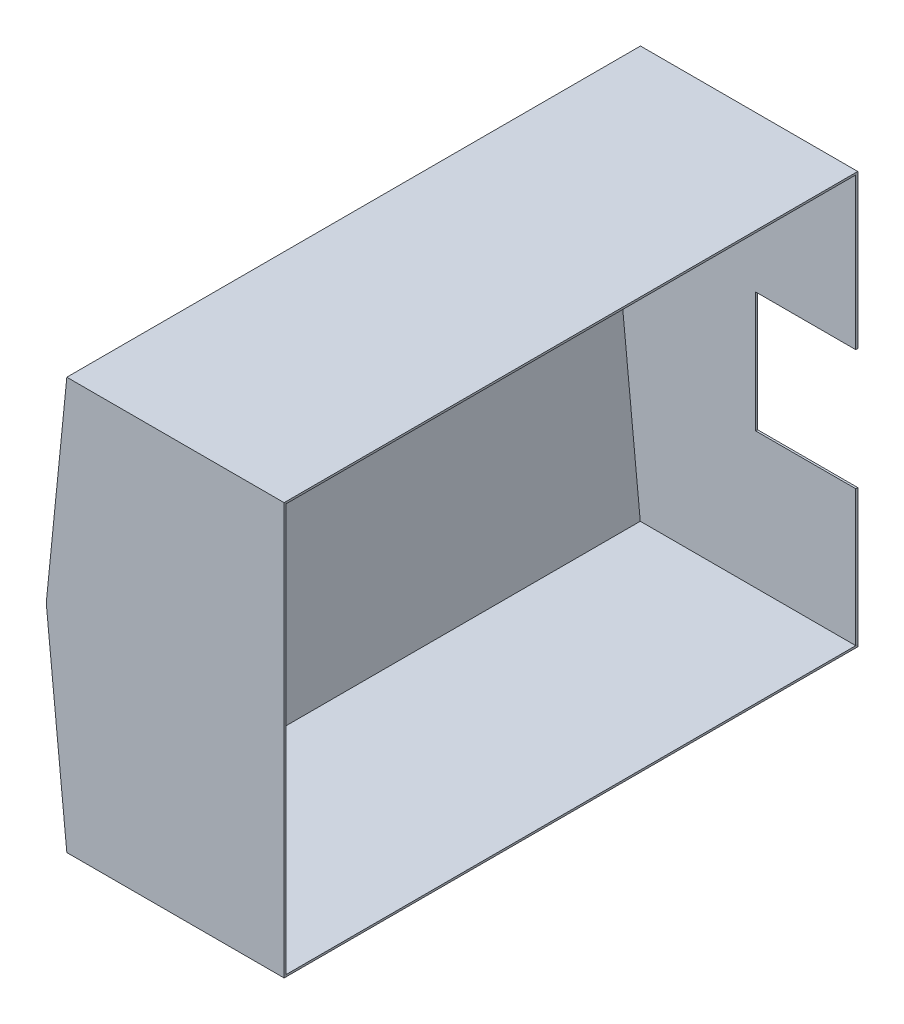
ISO-10303-21;
HEADER;
FILE_DESCRIPTION(('STEP AP214'),'2;1');
FILE_NAME('part.step','',(''),(''),'','','');
FILE_SCHEMA(('AUTOMOTIVE_DESIGN { 1 0 10303 214 1 1 1 1 }'));
ENDSEC;
DATA;
#1=APPLICATION_CONTEXT('core data for automotive mechanical design processes');
#2=APPLICATION_PROTOCOL_DEFINITION('international standard','automotive_design',2000,#1);
#3=PRODUCT_CONTEXT('',#1,'mechanical');
#4=PRODUCT('Part','Part','',(#3));
#5=PRODUCT_RELATED_PRODUCT_CATEGORY('part','',(#4));
#6=PRODUCT_DEFINITION_FORMATION('','',#4);
#7=PRODUCT_DEFINITION_CONTEXT('part definition',#1,'design');
#8=PRODUCT_DEFINITION('design','',#6,#7);
#9=PRODUCT_DEFINITION_SHAPE('','',#8);
#10=(LENGTH_UNIT() NAMED_UNIT(*) SI_UNIT(.MILLI.,.METRE.));
#11=(NAMED_UNIT(*) PLANE_ANGLE_UNIT() SI_UNIT($,.RADIAN.));
#12=(NAMED_UNIT(*) SI_UNIT($,.STERADIAN.) SOLID_ANGLE_UNIT());
#13=UNCERTAINTY_MEASURE_WITH_UNIT(LENGTH_MEASURE(1.E-05),#10,'distance_accuracy_value','');
#14=(GEOMETRIC_REPRESENTATION_CONTEXT(3) GLOBAL_UNCERTAINTY_ASSIGNED_CONTEXT((#13)) GLOBAL_UNIT_ASSIGNED_CONTEXT((#10,
#11,#12)) REPRESENTATION_CONTEXT('',''));
#15=CARTESIAN_POINT('',(0.,0.,0.));
#16=DIRECTION('',(0.,0.,1.));
#17=DIRECTION('',(1.,0.,0.));
#18=AXIS2_PLACEMENT_3D('',#15,#16,#17);
#19=CARTESIAN_POINT('',(2998.99999999998,-3829.13009448714,100.));
#20=DIRECTION('',(-0.999999996719112,-8.10047953470063E-05,0.));
#21=DIRECTION('',(8.10047953470063E-05,-0.999999996719112,0.));
#22=AXIS2_PLACEMENT_3D('',#19,#20,#21);
#23=PLANE('',#22);
#24=DIRECTION('',(-8.10047953470063E-05,0.999999996719112,0.));
#25=VECTOR('',#24,1.);
#26=CARTESIAN_POINT('',(2999.67018965715,-12102.5866485027,0.));
#27=LINE('',#26,#25);
#28=CARTESIAN_POINT('',(2999.00810047952,-3929.13009415905,0.));
#29=VERTEX_POINT('',#28);
#30=CARTESIAN_POINT('',(2998.99999999998,-3829.13009448714,0.));
#31=VERTEX_POINT('',#30);
#32=EDGE_CURVE('E156',#29,#31,#27,.T.);
#33=ORIENTED_EDGE('',*,*,#32,.F.);
#34=DIRECTION('',(0.,0.,-1.));
#35=VECTOR('',#34,1.);
#36=CARTESIAN_POINT('',(2999.00810047952,-3929.13009415905,100.));
#37=LINE('',#36,#35);
#38=CARTESIAN_POINT('',(2999.00810047952,-3929.13009415905,-28490.));
#39=VERTEX_POINT('',#38);
#40=EDGE_CURVE('E151',#29,#39,#37,.T.);
#41=ORIENTED_EDGE('',*,*,#40,.T.);
#42=DIRECTION('',(-8.10047953470063E-05,0.999999996719112,0.));
#43=VECTOR('',#42,1.);
#44=CARTESIAN_POINT('',(2998.99999999998,-3829.13009448714,-28490.));
#45=LINE('',#44,#43);
#46=CARTESIAN_POINT('',(2998.99999999998,-3829.13009448714,-28490.));
#47=VERTEX_POINT('',#46);
#48=EDGE_CURVE('E241',#39,#47,#45,.T.);
#49=ORIENTED_EDGE('',*,*,#48,.T.);
#50=DIRECTION('',(0.,0.,-1.));
#51=VECTOR('',#50,1.);
#52=CARTESIAN_POINT('',(2998.99999999998,-3829.13009448714,-28390.));
#53=LINE('',#52,#51);
#54=CARTESIAN_POINT('',(2998.99999999998,-3829.13009448714,-28390.));
#55=VERTEX_POINT('',#54);
#56=EDGE_CURVE('E224',#55,#47,#53,.T.);
#57=ORIENTED_EDGE('',*,*,#56,.F.);
#58=DIRECTION('',(0.,0.,-1.));
#59=VECTOR('',#58,1.);
#60=CARTESIAN_POINT('',(2998.99999999998,-3829.13009448714,100.));
#61=LINE('',#60,#59);
#62=EDGE_CURVE('E11',#31,#55,#61,.T.);
#63=ORIENTED_EDGE('',*,*,#62,.F.);
#64=EDGE_LOOP('',(#33,#41,#49,#57,#63));
#65=FACE_BOUND('',#64,.T.);
#66=ADVANCED_FACE('F30',(#65),#23,.F.);
#67=CARTESIAN_POINT('',(2998.99999999998,-3829.13009448714,100.));
#68=DIRECTION('',(8.10047953486023E-05,-0.999999996719112,0.));
#69=DIRECTION('',(0.999999996719112,8.10047953486023E-05,0.));
#70=AXIS2_PLACEMENT_3D('',#67,#68,#69);
#71=PLANE('',#70);
#72=DIRECTION('',(-0.999999996719112,-8.10047953486023E-05,0.));
#73=VECTOR('',#72,1.);
#74=CARTESIAN_POINT('',(-2929.38473390512,-3829.61032208084,0.));
#75=LINE('',#74,#73);
#76=CARTESIAN_POINT('',(-7739.93843276424,-3830.,0.));
#77=VERTEX_POINT('',#76);
#78=EDGE_CURVE('E229',#31,#77,#75,.T.);
#79=ORIENTED_EDGE('',*,*,#78,.F.);
#80=ORIENTED_EDGE('',*,*,#62,.T.);
#81=DIRECTION('',(-0.999999996719112,-8.10047953486023E-05,0.));
#82=VECTOR('',#81,1.);
#83=CARTESIAN_POINT('',(2998.99999999998,-3829.13009448714,-28390.));
#84=LINE('',#83,#82);
#85=CARTESIAN_POINT('',(-7739.93843276424,-3830.,-28390.));
#86=VERTEX_POINT('',#85);
#87=EDGE_CURVE('E201',#55,#86,#84,.T.);
#88=ORIENTED_EDGE('',*,*,#87,.T.);
#89=DIRECTION('',(0.,0.,-1.));
#90=VECTOR('',#89,1.);
#91=CARTESIAN_POINT('',(-7739.93843276424,-3830.,100.));
#92=LINE('',#91,#90);
#93=EDGE_CURVE('E37',#77,#86,#92,.T.);
#94=ORIENTED_EDGE('',*,*,#93,.F.);
#95=EDGE_LOOP('',(#79,#80,#88,#94));
#96=FACE_BOUND('',#95,.T.);
#97=ADVANCED_FACE('F323',(#96),#71,.F.);
#98=CARTESIAN_POINT('',(-7739.93843276424,-3830.,100.));
#99=DIRECTION('',(-0.995037190209989,-0.0995037190209953,0.));
#100=DIRECTION('',(0.0995037190209953,-0.99503719020999,0.));
#101=AXIS2_PLACEMENT_3D('',#98,#99,#100);
#102=PLANE('',#101);
#103=DIRECTION('',(-0.0995037190209953,0.99503719020999,0.));
#104=VECTOR('',#103,1.);
#105=CARTESIAN_POINT('',(-6873.18702039318,-12497.5141237109,0.));
#106=LINE('',#105,#104);
#107=CARTESIAN_POINT('',(-8755.93843276419,6329.99999999988,0.));
#108=VERTEX_POINT('',#107);
#109=EDGE_CURVE('E289',#77,#108,#106,.T.);
#110=ORIENTED_EDGE('',*,*,#109,.F.);
#111=ORIENTED_EDGE('',*,*,#93,.T.);
#112=DIRECTION('',(-0.0995037190209953,0.995037190209989,0.));
#113=VECTOR('',#112,1.);
#114=CARTESIAN_POINT('',(-7739.93843276424,-3830.,-28390.));
#115=LINE('',#114,#113);
#116=CARTESIAN_POINT('',(-8755.93843276419,6329.99999999988,-28390.));
#117=VERTEX_POINT('',#116);
#118=EDGE_CURVE('E197',#86,#117,#115,.T.);
#119=ORIENTED_EDGE('',*,*,#118,.T.);
#120=DIRECTION('',(0.,0.,-1.));
#121=VECTOR('',#120,1.);
#122=CARTESIAN_POINT('',(-8755.93843276419,6329.99999999988,100.));
#123=LINE('',#122,#121);
#124=EDGE_CURVE('E185',#108,#117,#123,.T.);
#125=ORIENTED_EDGE('',*,*,#124,.F.);
#126=EDGE_LOOP('',(#110,#111,#119,#125));
#127=FACE_BOUND('',#126,.T.);
#128=ADVANCED_FACE('F198',(#127),#102,.F.);
#129=CARTESIAN_POINT('',(-8755.93843276419,6329.99999999988,100.));
#130=DIRECTION('',(-0.99503719020999,0.099503719020993,0.));
#131=DIRECTION('',(-0.0995037190209931,-0.99503719020999,0.));
#132=AXIS2_PLACEMENT_3D('',#129,#130,#131);
#133=PLANE('',#132);
#134=DIRECTION('',(0.099503719020993,0.99503719020999,0.));
#135=VECTOR('',#134,1.);
#136=CARTESIAN_POINT('',(-10523.2992730853,-11343.6084032127,0.));
#137=LINE('',#136,#135);
#138=CARTESIAN_POINT('',(-7740.07721241072,16488.6122035352,0.));
#139=VERTEX_POINT('',#138);
#140=EDGE_CURVE('E195',#108,#139,#137,.T.);
#141=ORIENTED_EDGE('',*,*,#140,.F.);
#142=ORIENTED_EDGE('',*,*,#124,.T.);
#143=DIRECTION('',(0.099503719020993,0.99503719020999,0.));
#144=VECTOR('',#143,1.);
#145=CARTESIAN_POINT('',(-8755.93843276419,6329.99999999988,-28390.));
#146=LINE('',#145,#144);
#147=CARTESIAN_POINT('',(-7740.07721241072,16488.6122035352,-28390.));
#148=VERTEX_POINT('',#147);
#149=EDGE_CURVE('E193',#117,#148,#146,.T.);
#150=ORIENTED_EDGE('',*,*,#149,.T.);
#151=DIRECTION('',(0.,0.,-1.));
#152=VECTOR('',#151,1.);
#153=CARTESIAN_POINT('',(-7740.07721241072,16488.6122035352,100.));
#154=LINE('',#153,#152);
#155=EDGE_CURVE('E183',#139,#148,#154,.T.);
#156=ORIENTED_EDGE('',*,*,#155,.F.);
#157=EDGE_LOOP('',(#141,#142,#150,#156));
#158=FACE_BOUND('',#157,.T.);
#159=ADVANCED_FACE('F190',(#158),#133,.F.);
#160=CARTESIAN_POINT('',(2998.99999999998,16488.6122035352,100.));
#161=DIRECTION('',(0.,1.,0.));
#162=DIRECTION('',(0.,0.,1.));
#163=AXIS2_PLACEMENT_3D('',#160,#161,#162);
#164=PLANE('',#163);
#165=DIRECTION('',(1.,0.,0.));
#166=VECTOR('',#165,1.);
#167=CARTESIAN_POINT('',(-2928.71454424794,16488.6122035352,0.));
#168=LINE('',#167,#166);
#169=CARTESIAN_POINT('',(2998.99999999998,16488.6122035352,0.));
#170=VERTEX_POINT('',#169);
#171=EDGE_CURVE('E292',#139,#170,#168,.T.);
#172=ORIENTED_EDGE('',*,*,#171,.F.);
#173=ORIENTED_EDGE('',*,*,#155,.T.);
#174=DIRECTION('',(1.,0.,0.));
#175=VECTOR('',#174,1.);
#176=CARTESIAN_POINT('',(-7740.07721241072,16488.6122035352,-28390.));
#177=LINE('',#176,#175);
#178=CARTESIAN_POINT('',(2998.99999999998,16488.6122035352,-28390.));
#179=VERTEX_POINT('',#178);
#180=EDGE_CURVE('E207',#148,#179,#177,.T.);
#181=ORIENTED_EDGE('',*,*,#180,.T.);
#182=DIRECTION('',(0.,0.,-1.));
#183=VECTOR('',#182,1.);
#184=CARTESIAN_POINT('',(2998.99999999998,16488.6122035352,100.));
#185=LINE('',#184,#183);
#186=EDGE_CURVE('E181',#170,#179,#185,.T.);
#187=ORIENTED_EDGE('',*,*,#186,.F.);
#188=EDGE_LOOP('',(#172,#173,#181,#187));
#189=FACE_BOUND('',#188,.T.);
#190=ADVANCED_FACE('F299',(#189),#164,.F.);
#191=CARTESIAN_POINT('',(2998.99999999998,16488.6122035352,100.));
#192=DIRECTION('',(-1.,0.,0.));
#193=DIRECTION('',(0.,0.,1.));
#194=AXIS2_PLACEMENT_3D('',#191,#192,#193);
#195=PLANE('',#194);
#196=DIRECTION('',(0.,1.,0.));
#197=VECTOR('',#196,1.);
#198=CARTESIAN_POINT('',(2998.99999999998,-12103.0668760964,0.));
#199=LINE('',#198,#197);
#200=CARTESIAN_POINT('',(2998.99999999998,16588.6122035352,0.));
#201=VERTEX_POINT('',#200);
#202=EDGE_CURVE('E158',#170,#201,#199,.T.);
#203=ORIENTED_EDGE('',*,*,#202,.F.);
#204=ORIENTED_EDGE('',*,*,#186,.T.);
#205=DIRECTION('',(0.,-1.,0.));
#206=VECTOR('',#205,1.);
#207=CARTESIAN_POINT('',(2998.99999999998,16488.6122035352,-28390.));
#208=LINE('',#207,#206);
#209=CARTESIAN_POINT('',(2998.99999999998,8944.79822539326,-28390.));
#210=VERTEX_POINT('',#209);
#211=EDGE_CURVE('E209',#179,#210,#208,.T.);
#212=ORIENTED_EDGE('',*,*,#211,.T.);
#213=DIRECTION('',(0.,0.,-1.));
#214=VECTOR('',#213,1.);
#215=CARTESIAN_POINT('',(2998.99999999998,8944.79822539326,-28390.));
#216=LINE('',#215,#214);
#217=CARTESIAN_POINT('',(2998.99999999998,8944.79822539326,-28490.));
#218=VERTEX_POINT('',#217);
#219=EDGE_CURVE('E246',#210,#218,#216,.T.);
#220=ORIENTED_EDGE('',*,*,#219,.T.);
#221=DIRECTION('',(0.,1.,0.));
#222=VECTOR('',#221,1.);
#223=CARTESIAN_POINT('',(2998.99999999998,16488.6122035352,-28490.));
#224=LINE('',#223,#222);
#225=CARTESIAN_POINT('',(2998.99999999998,16588.6122035352,-28490.));
#226=VERTEX_POINT('',#225);
#227=EDGE_CURVE('E252',#218,#226,#224,.T.);
#228=ORIENTED_EDGE('',*,*,#227,.T.);
#229=DIRECTION('',(0.,0.,-1.));
#230=VECTOR('',#229,1.);
#231=CARTESIAN_POINT('',(2998.99999999998,16588.6122035352,100.));
#232=LINE('',#231,#230);
#233=EDGE_CURVE('E177',#201,#226,#232,.T.);
#234=ORIENTED_EDGE('',*,*,#233,.F.);
#235=EDGE_LOOP('',(#203,#204,#212,#220,#228,#234));
#236=FACE_BOUND('',#235,.T.);
#237=ADVANCED_FACE('F298',(#236),#195,.F.);
#238=CARTESIAN_POINT('',(2998.99999999998,16588.6122035352,100.));
#239=DIRECTION('',(0.,-1.,0.));
#240=DIRECTION('',(0.,0.,-1.));
#241=AXIS2_PLACEMENT_3D('',#238,#239,#240);
#242=PLANE('',#241);
#243=CARTESIAN_POINT('',(2998.99999999998,16588.6122035352,100.));
#244=VERTEX_POINT('',#243);
#245=EDGE_CURVE('E178',#244,#201,#232,.T.);
#246=ORIENTED_EDGE('',*,*,#245,.T.);
#247=ORIENTED_EDGE('',*,*,#233,.T.);
#248=DIRECTION('',(-1.,0.,0.));
#249=VECTOR('',#248,1.);
#250=CARTESIAN_POINT('',(2998.99999999998,16588.6122035352,-28490.));
#251=LINE('',#250,#249);
#252=CARTESIAN_POINT('',(-7830.57596862193,16588.6122035352,-28490.));
#253=VERTEX_POINT('',#252);
#254=EDGE_CURVE('E255',#226,#253,#251,.T.);
#255=ORIENTED_EDGE('',*,*,#254,.T.);
#256=DIRECTION('',(0.,0.,-1.));
#257=VECTOR('',#256,1.);
#258=CARTESIAN_POINT('',(-7830.57596862193,16588.6122035352,100.));
#259=LINE('',#258,#257);
#260=CARTESIAN_POINT('',(-7830.57596862193,16588.6122035352,100.));
#261=VERTEX_POINT('',#260);
#262=EDGE_CURVE('E175',#261,#253,#259,.T.);
#263=ORIENTED_EDGE('',*,*,#262,.F.);
#264=DIRECTION('',(-1.,0.,0.));
#265=VECTOR('',#264,1.);
#266=CARTESIAN_POINT('',(2998.99999999998,16588.6122035352,100.));
#267=LINE('',#266,#265);
#268=EDGE_CURVE('E265',#244,#261,#267,.T.);
#269=ORIENTED_EDGE('',*,*,#268,.F.);
#270=EDGE_LOOP('',(#246,#247,#255,#263,#269));
#271=FACE_BOUND('',#270,.T.);
#272=ADVANCED_FACE('F310',(#271),#242,.F.);
#273=CARTESIAN_POINT('',(-8856.4371889754,6329.99999999988,100.));
#274=DIRECTION('',(0.99503719020999,-0.0995037190209931,0.));
#275=DIRECTION('',(0.0995037190209931,0.99503719020999,0.));
#276=AXIS2_PLACEMENT_3D('',#273,#274,#275);
#277=PLANE('',#276);
#278=ORIENTED_EDGE('',*,*,#262,.T.);
#279=DIRECTION('',(-0.0995037190209931,-0.99503719020999,0.));
#280=VECTOR('',#279,1.);
#281=CARTESIAN_POINT('',(-8856.4371889754,6329.99999999988,-28490.));
#282=LINE('',#281,#280);
#283=CARTESIAN_POINT('',(-8856.4371889754,6329.99999999988,-28490.));
#284=VERTEX_POINT('',#283);
#285=EDGE_CURVE('E258',#253,#284,#282,.T.);
#286=ORIENTED_EDGE('',*,*,#285,.T.);
#287=DIRECTION('',(0.,0.,-1.));
#288=VECTOR('',#287,1.);
#289=CARTESIAN_POINT('',(-8856.4371889754,6329.99999999988,100.));
#290=LINE('',#289,#288);
#291=CARTESIAN_POINT('',(-8856.4371889754,6329.99999999988,100.));
#292=VERTEX_POINT('',#291);
#293=EDGE_CURVE('E173',#292,#284,#290,.T.);
#294=ORIENTED_EDGE('',*,*,#293,.F.);
#295=DIRECTION('',(-0.0995037190209931,-0.99503719020999,0.));
#296=VECTOR('',#295,1.);
#297=CARTESIAN_POINT('',(-8856.4371889754,6329.99999999988,100.));
#298=LINE('',#297,#296);
#299=EDGE_CURVE('E267',#261,#292,#298,.T.);
#300=ORIENTED_EDGE('',*,*,#299,.F.);
#301=EDGE_LOOP('',(#278,#286,#294,#300));
#302=FACE_BOUND('',#301,.T.);
#303=ADVANCED_FACE('F313',(#302),#277,.F.);
#304=CARTESIAN_POINT('',(-7830.43645586525,-3930.00733110196,100.));
#305=DIRECTION('',(0.99503719020999,0.0995037190209953,0.));
#306=DIRECTION('',(-0.0995037190209953,0.99503719020999,0.));
#307=AXIS2_PLACEMENT_3D('',#304,#305,#306);
#308=PLANE('',#307);
#309=ORIENTED_EDGE('',*,*,#293,.T.);
#310=DIRECTION('',(0.0995037190209953,-0.995037190209989,0.));
#311=VECTOR('',#310,1.);
#312=CARTESIAN_POINT('',(-7830.43645586525,-3930.00733110196,-28490.));
#313=LINE('',#312,#311);
#314=CARTESIAN_POINT('',(-7830.43645586525,-3930.00733110196,-28490.));
#315=VERTEX_POINT('',#314);
#316=EDGE_CURVE('E261',#284,#315,#313,.T.);
#317=ORIENTED_EDGE('',*,*,#316,.T.);
#318=DIRECTION('',(0.,0.,-1.));
#319=VECTOR('',#318,1.);
#320=CARTESIAN_POINT('',(-7830.43645586525,-3930.00733110196,100.));
#321=LINE('',#320,#319);
#322=CARTESIAN_POINT('',(-7830.43645586525,-3930.00733110196,100.));
#323=VERTEX_POINT('',#322);
#324=EDGE_CURVE('E150',#323,#315,#321,.T.);
#325=ORIENTED_EDGE('',*,*,#324,.F.);
#326=DIRECTION('',(0.0995037190209953,-0.995037190209989,0.));
#327=VECTOR('',#326,1.);
#328=CARTESIAN_POINT('',(-7830.43645586525,-3930.00733110196,100.));
#329=LINE('',#328,#327);
#330=EDGE_CURVE('E168',#292,#323,#329,.T.);
#331=ORIENTED_EDGE('',*,*,#330,.F.);
#332=EDGE_LOOP('',(#309,#317,#325,#331));
#333=FACE_BOUND('',#332,.T.);
#334=ADVANCED_FACE('F275',(#333),#308,.F.);
#335=CARTESIAN_POINT('',(2999.00810047952,-3929.13009415905,100.));
#336=DIRECTION('',(-8.10047953486135E-05,0.999999996719112,0.));
#337=DIRECTION('',(-0.999999996719112,-8.10047953486135E-05,0.));
#338=AXIS2_PLACEMENT_3D('',#335,#336,#337);
#339=PLANE('',#338);
#340=ORIENTED_EDGE('',*,*,#324,.T.);
#341=DIRECTION('',(0.999999996719112,8.10047953486135E-05,0.));
#342=VECTOR('',#341,1.);
#343=CARTESIAN_POINT('',(2999.00810047952,-3929.13009415905,-28490.));
#344=LINE('',#343,#342);
#345=EDGE_CURVE('E166',#315,#39,#344,.T.);
#346=ORIENTED_EDGE('',*,*,#345,.T.);
#347=ORIENTED_EDGE('',*,*,#40,.F.);
#348=CARTESIAN_POINT('',(2999.00810047952,-3929.13009415905,100.));
#349=VERTEX_POINT('',#348);
#350=EDGE_CURVE('E139',#349,#29,#37,.T.);
#351=ORIENTED_EDGE('',*,*,#350,.F.);
#352=DIRECTION('',(0.999999996719112,8.10047953486135E-05,0.));
#353=VECTOR('',#352,1.);
#354=CARTESIAN_POINT('',(2999.00810047952,-3929.13009415905,100.));
#355=LINE('',#354,#353);
#356=EDGE_CURVE('E167',#323,#349,#355,.T.);
#357=ORIENTED_EDGE('',*,*,#356,.F.);
#358=EDGE_LOOP('',(#340,#346,#347,#351,#357));
#359=FACE_BOUND('',#358,.T.);
#360=ADVANCED_FACE('F164',(#359),#339,.F.);
#361=CARTESIAN_POINT('',(2999.00810047952,-3929.13009415905,100.));
#362=DIRECTION('',(0.,0.,-1.));
#363=DIRECTION('',(-1.,0.,0.));
#364=AXIS2_PLACEMENT_3D('',#361,#362,#363);
#365=PLANE('',#364);
#366=ORIENTED_EDGE('',*,*,#356,.T.);
#367=DIRECTION('',(-3.94803649308447E-07,0.999999999999922,0.));
#368=VECTOR('',#367,1.);
#369=CARTESIAN_POINT('',(2999.01132757866,-12103.0645358085,100.));
#370=LINE('',#369,#368);
#371=EDGE_CURVE('E145',#349,#244,#370,.T.);
#372=ORIENTED_EDGE('',*,*,#371,.T.);
#373=ORIENTED_EDGE('',*,*,#268,.T.);
#374=ORIENTED_EDGE('',*,*,#299,.T.);
#375=ORIENTED_EDGE('',*,*,#330,.T.);
#376=EDGE_LOOP('',(#366,#372,#373,#374,#375));
#377=FACE_BOUND('',#376,.T.);
#378=ADVANCED_FACE('F271',(#377),#365,.F.);
#379=CARTESIAN_POINT('',(2999.00810047952,-3929.13009415905,-28490.));
#380=DIRECTION('',(0.,0.,-1.));
#381=DIRECTION('',(-1.,0.,0.));
#382=AXIS2_PLACEMENT_3D('',#379,#380,#381);
#383=PLANE('',#382);
#384=ORIENTED_EDGE('',*,*,#227,.F.);
#385=DIRECTION('',(-1.,0.,0.));
#386=VECTOR('',#385,1.);
#387=CARTESIAN_POINT('',(2998.99999999998,8944.79822539326,-28490.));
#388=LINE('',#387,#386);
#389=CARTESIAN_POINT('',(-1999.7213525321,8944.79822539326,-28490.));
#390=VERTEX_POINT('',#389);
#391=EDGE_CURVE('E228',#218,#390,#388,.T.);
#392=ORIENTED_EDGE('',*,*,#391,.T.);
#393=DIRECTION('',(0.,-1.,0.));
#394=VECTOR('',#393,1.);
#395=CARTESIAN_POINT('',(-1999.7213525321,8944.79822539326,-28490.));
#396=LINE('',#395,#394);
#397=CARTESIAN_POINT('',(-1999.7213525321,2944.79822539326,-28490.));
#398=VERTEX_POINT('',#397);
#399=EDGE_CURVE('E232',#390,#398,#396,.T.);
#400=ORIENTED_EDGE('',*,*,#399,.T.);
#401=DIRECTION('',(1.,0.,0.));
#402=VECTOR('',#401,1.);
#403=CARTESIAN_POINT('',(-1999.7213525321,2944.79822539326,-28490.));
#404=LINE('',#403,#402);
#405=CARTESIAN_POINT('',(2998.99999999998,2944.79822539326,-28490.));
#406=VERTEX_POINT('',#405);
#407=EDGE_CURVE('E235',#398,#406,#404,.T.);
#408=ORIENTED_EDGE('',*,*,#407,.T.);
#409=DIRECTION('',(0.,-1.,0.));
#410=VECTOR('',#409,1.);
#411=CARTESIAN_POINT('',(2998.99999999998,2944.79822539326,-28490.));
#412=LINE('',#411,#410);
#413=EDGE_CURVE('E225',#406,#47,#412,.T.);
#414=ORIENTED_EDGE('',*,*,#413,.T.);
#415=ORIENTED_EDGE('',*,*,#48,.F.);
#416=ORIENTED_EDGE('',*,*,#345,.F.);
#417=ORIENTED_EDGE('',*,*,#316,.F.);
#418=ORIENTED_EDGE('',*,*,#285,.F.);
#419=ORIENTED_EDGE('',*,*,#254,.F.);
#420=EDGE_LOOP('',(#384,#392,#400,#408,#414,#415,#416,#417,#418,#419));
#421=FACE_BOUND('',#420,.T.);
#422=ADVANCED_FACE('F279',(#421),#383,.T.);
#423=CARTESIAN_POINT('',(2998.99999999998,2944.79822539326,-28390.));
#424=DIRECTION('',(1.,0.,0.));
#425=DIRECTION('',(0.,0.,-1.));
#426=AXIS2_PLACEMENT_3D('',#423,#424,#425);
#427=PLANE('',#426);
#428=ORIENTED_EDGE('',*,*,#413,.F.);
#429=DIRECTION('',(0.,0.,-1.));
#430=VECTOR('',#429,1.);
#431=CARTESIAN_POINT('',(2998.99999999998,2944.79822539326,-28390.));
#432=LINE('',#431,#430);
#433=CARTESIAN_POINT('',(2998.99999999998,2944.79822539326,-28390.));
#434=VERTEX_POINT('',#433);
#435=EDGE_CURVE('E239',#434,#406,#432,.T.);
#436=ORIENTED_EDGE('',*,*,#435,.F.);
#437=DIRECTION('',(0.,-1.,0.));
#438=VECTOR('',#437,1.);
#439=CARTESIAN_POINT('',(2998.99999999998,2944.79822539326,-28390.));
#440=LINE('',#439,#438);
#441=EDGE_CURVE('E238',#434,#55,#440,.T.);
#442=ORIENTED_EDGE('',*,*,#441,.T.);
#443=ORIENTED_EDGE('',*,*,#56,.T.);
#444=EDGE_LOOP('',(#428,#436,#442,#443));
#445=FACE_BOUND('',#444,.T.);
#446=ADVANCED_FACE('F283',(#445),#427,.T.);
#447=CARTESIAN_POINT('',(-1999.7213525321,2944.79822539326,-28390.));
#448=DIRECTION('',(0.,1.,0.));
#449=DIRECTION('',(-1.,0.,0.));
#450=AXIS2_PLACEMENT_3D('',#447,#448,#449);
#451=PLANE('',#450);
#452=ORIENTED_EDGE('',*,*,#407,.F.);
#453=DIRECTION('',(0.,0.,-1.));
#454=VECTOR('',#453,1.);
#455=CARTESIAN_POINT('',(-1999.7213525321,2944.79822539326,-28390.));
#456=LINE('',#455,#454);
#457=CARTESIAN_POINT('',(-1999.7213525321,2944.79822539326,-28390.));
#458=VERTEX_POINT('',#457);
#459=EDGE_CURVE('E242',#458,#398,#456,.T.);
#460=ORIENTED_EDGE('',*,*,#459,.F.);
#461=DIRECTION('',(1.,0.,0.));
#462=VECTOR('',#461,1.);
#463=CARTESIAN_POINT('',(-1999.7213525321,2944.79822539326,-28390.));
#464=LINE('',#463,#462);
#465=EDGE_CURVE('E221',#458,#434,#464,.T.);
#466=ORIENTED_EDGE('',*,*,#465,.T.);
#467=ORIENTED_EDGE('',*,*,#435,.T.);
#468=EDGE_LOOP('',(#452,#460,#466,#467));
#469=FACE_BOUND('',#468,.T.);
#470=ADVANCED_FACE('F389',(#469),#451,.T.);
#471=CARTESIAN_POINT('',(-1999.7213525321,8944.79822539326,-28390.));
#472=DIRECTION('',(1.,0.,0.));
#473=DIRECTION('',(0.,1.,0.));
#474=AXIS2_PLACEMENT_3D('',#471,#472,#473);
#475=PLANE('',#474);
#476=ORIENTED_EDGE('',*,*,#399,.F.);
#477=DIRECTION('',(0.,0.,-1.));
#478=VECTOR('',#477,1.);
#479=CARTESIAN_POINT('',(-1999.7213525321,8944.79822539326,-28390.));
#480=LINE('',#479,#478);
#481=CARTESIAN_POINT('',(-1999.7213525321,8944.79822539326,-28390.));
#482=VERTEX_POINT('',#481);
#483=EDGE_CURVE('E244',#482,#390,#480,.T.);
#484=ORIENTED_EDGE('',*,*,#483,.F.);
#485=DIRECTION('',(0.,-1.,0.));
#486=VECTOR('',#485,1.);
#487=CARTESIAN_POINT('',(-1999.7213525321,8944.79822539326,-28390.));
#488=LINE('',#487,#486);
#489=EDGE_CURVE('E218',#482,#458,#488,.T.);
#490=ORIENTED_EDGE('',*,*,#489,.T.);
#491=ORIENTED_EDGE('',*,*,#459,.T.);
#492=EDGE_LOOP('',(#476,#484,#490,#491));
#493=FACE_BOUND('',#492,.T.);
#494=ADVANCED_FACE('F392',(#493),#475,.T.);
#495=CARTESIAN_POINT('',(2998.99999999998,8944.79822539326,-28390.));
#496=DIRECTION('',(0.,-1.,0.));
#497=DIRECTION('',(0.,0.,-1.));
#498=AXIS2_PLACEMENT_3D('',#495,#496,#497);
#499=PLANE('',#498);
#500=ORIENTED_EDGE('',*,*,#391,.F.);
#501=ORIENTED_EDGE('',*,*,#219,.F.);
#502=DIRECTION('',(-1.,0.,0.));
#503=VECTOR('',#502,1.);
#504=CARTESIAN_POINT('',(2998.99999999998,8944.79822539326,-28390.));
#505=LINE('',#504,#503);
#506=EDGE_CURVE('E215',#210,#482,#505,.T.);
#507=ORIENTED_EDGE('',*,*,#506,.T.);
#508=ORIENTED_EDGE('',*,*,#483,.T.);
#509=EDGE_LOOP('',(#500,#501,#507,#508));
#510=FACE_BOUND('',#509,.T.);
#511=ADVANCED_FACE('F304',(#510),#499,.T.);
#512=CARTESIAN_POINT('',(2998.99999999998,16488.6122035352,-28390.));
#513=DIRECTION('',(0.,0.,1.));
#514=DIRECTION('',(1.,0.,0.));
#515=AXIS2_PLACEMENT_3D('',#512,#513,#514);
#516=PLANE('',#515);
#517=ORIENTED_EDGE('',*,*,#441,.F.);
#518=ORIENTED_EDGE('',*,*,#465,.F.);
#519=ORIENTED_EDGE('',*,*,#489,.F.);
#520=ORIENTED_EDGE('',*,*,#506,.F.);
#521=ORIENTED_EDGE('',*,*,#211,.F.);
#522=ORIENTED_EDGE('',*,*,#180,.F.);
#523=ORIENTED_EDGE('',*,*,#149,.F.);
#524=ORIENTED_EDGE('',*,*,#118,.F.);
#525=ORIENTED_EDGE('',*,*,#87,.F.);
#526=EDGE_LOOP('',(#517,#518,#519,#520,#521,#522,#523,#524,#525));
#527=FACE_BOUND('',#526,.T.);
#528=ADVANCED_FACE('F204',(#527),#516,.T.);
#529=CARTESIAN_POINT('',(2999.01132757866,-12103.0645358085,0.));
#530=DIRECTION('',(0.999999999999922,3.94803649308447E-07,0.));
#531=DIRECTION('',(-3.94803649308447E-07,0.999999999999922,0.));
#532=AXIS2_PLACEMENT_3D('',#529,#530,#531);
#533=PLANE('',#532);
#534=ORIENTED_EDGE('',*,*,#371,.F.);
#535=ORIENTED_EDGE('',*,*,#350,.T.);
#536=DIRECTION('',(-3.94803649308447E-07,0.999999999999922,0.));
#537=VECTOR('',#536,1.);
#538=CARTESIAN_POINT('',(2999.01132757866,-12103.0645358085,0.));
#539=LINE('',#538,#537);
#540=EDGE_CURVE('E143',#29,#201,#539,.T.);
#541=ORIENTED_EDGE('',*,*,#540,.T.);
#542=ORIENTED_EDGE('',*,*,#245,.F.);
#543=EDGE_LOOP('',(#534,#535,#541,#542));
#544=FACE_BOUND('',#543,.T.);
#545=ADVANCED_FACE('F141',(#544),#533,.T.);
#546=CARTESIAN_POINT('',(-2928.71454424794,-12103.0668760964,0.));
#547=DIRECTION('',(0.,0.,1.));
#548=DIRECTION('',(1.,0.,0.));
#549=AXIS2_PLACEMENT_3D('',#546,#547,#548);
#550=PLANE('',#549);
#551=ORIENTED_EDGE('',*,*,#32,.T.);
#552=ORIENTED_EDGE('',*,*,#78,.T.);
#553=ORIENTED_EDGE('',*,*,#109,.T.);
#554=ORIENTED_EDGE('',*,*,#140,.T.);
#555=ORIENTED_EDGE('',*,*,#171,.T.);
#556=ORIENTED_EDGE('',*,*,#202,.T.);
#557=ORIENTED_EDGE('',*,*,#540,.F.);
#558=EDGE_LOOP('',(#551,#552,#553,#554,#555,#556,#557));
#559=FACE_BOUND('',#558,.T.);
#560=ADVANCED_FACE('F155',(#559),#550,.F.);
#561=CLOSED_SHELL('',(#66,#97,#128,#159,#190,#237,#272,#303,#334,#360,#378,#422,#446,#470,#494,
#511,#528,#545,#560));
#562=MANIFOLD_SOLID_BREP('B2',#561);
#563=ADVANCED_BREP_SHAPE_REPRESENTATION('',(#18,#562),#14);
#564=SHAPE_DEFINITION_REPRESENTATION(#9,#563);
ENDSEC;
END-ISO-10303-21;
